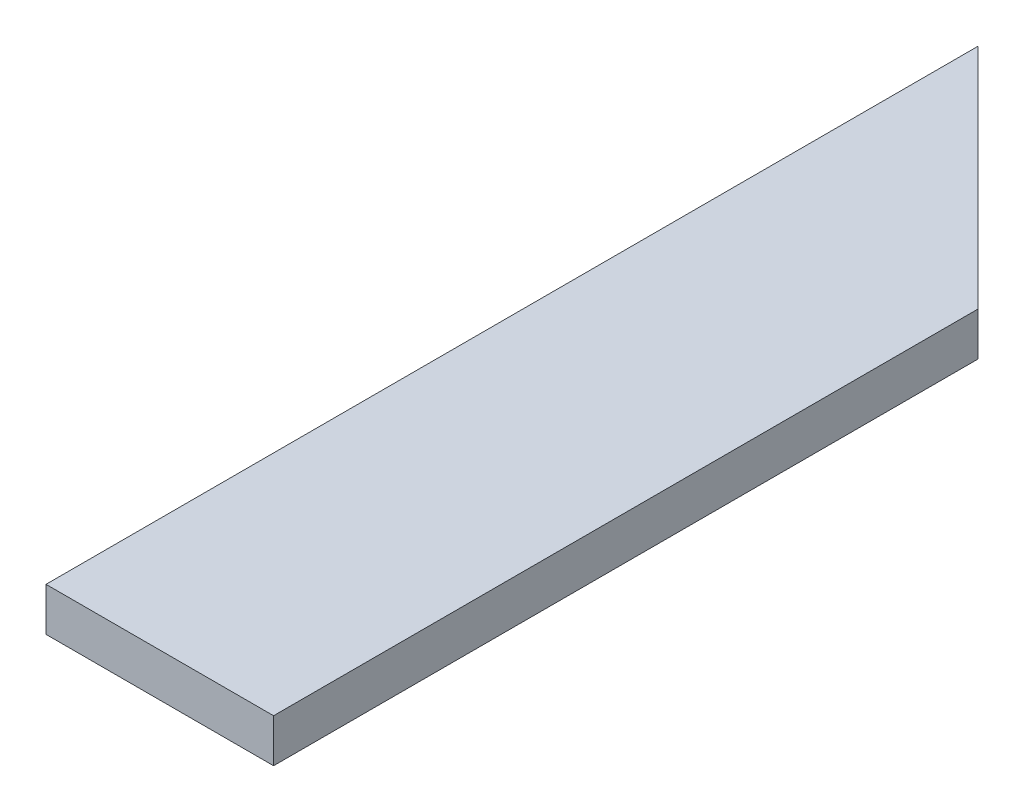
ISO-10303-21;
HEADER;
FILE_DESCRIPTION(('STEP AP214'),'2;1');
FILE_NAME('part.step','',(''),(''),'','','');
FILE_SCHEMA(('AUTOMOTIVE_DESIGN { 1 0 10303 214 1 1 1 1 }'));
ENDSEC;
DATA;
#1=APPLICATION_CONTEXT('core data for automotive mechanical design processes');
#2=APPLICATION_PROTOCOL_DEFINITION('international standard','automotive_design',2000,#1);
#3=PRODUCT_CONTEXT('',#1,'mechanical');
#4=PRODUCT('Part','Part','',(#3));
#5=PRODUCT_RELATED_PRODUCT_CATEGORY('part','',(#4));
#6=PRODUCT_DEFINITION_FORMATION('','',#4);
#7=PRODUCT_DEFINITION_CONTEXT('part definition',#1,'design');
#8=PRODUCT_DEFINITION('design','',#6,#7);
#9=PRODUCT_DEFINITION_SHAPE('','',#8);
#10=(LENGTH_UNIT() NAMED_UNIT(*) SI_UNIT(.MILLI.,.METRE.));
#11=(NAMED_UNIT(*) PLANE_ANGLE_UNIT() SI_UNIT($,.RADIAN.));
#12=(NAMED_UNIT(*) SI_UNIT($,.STERADIAN.) SOLID_ANGLE_UNIT());
#13=UNCERTAINTY_MEASURE_WITH_UNIT(LENGTH_MEASURE(1.E-05),#10,'distance_accuracy_value','');
#14=(GEOMETRIC_REPRESENTATION_CONTEXT(3) GLOBAL_UNCERTAINTY_ASSIGNED_CONTEXT((#13)) GLOBAL_UNIT_ASSIGNED_CONTEXT((#10,
#11,#12)) REPRESENTATION_CONTEXT('',''));
#15=CARTESIAN_POINT('',(0.,0.,0.));
#16=DIRECTION('',(0.,0.,1.));
#17=DIRECTION('',(1.,0.,0.));
#18=AXIS2_PLACEMENT_3D('',#15,#16,#17);
#19=CARTESIAN_POINT('',(0.,8.,130.));
#20=DIRECTION('',(0.,0.,-1.));
#21=DIRECTION('',(-1.,0.,0.));
#22=AXIS2_PLACEMENT_3D('',#19,#20,#21);
#23=PLANE('',#22);
#24=DIRECTION('',(1.,0.,0.));
#25=VECTOR('',#24,1.);
#26=CARTESIAN_POINT('',(0.,0.,130.));
#27=LINE('',#26,#25);
#28=CARTESIAN_POINT('',(0.,0.,130.));
#29=VERTEX_POINT('',#28);
#30=CARTESIAN_POINT('',(42.,0.,130.));
#31=VERTEX_POINT('',#30);
#32=EDGE_CURVE('E89',#29,#31,#27,.T.);
#33=ORIENTED_EDGE('',*,*,#32,.T.);
#34=DIRECTION('',(0.,-1.,0.));
#35=VECTOR('',#34,1.);
#36=CARTESIAN_POINT('',(42.,8.,130.));
#37=LINE('',#36,#35);
#38=CARTESIAN_POINT('',(42.,8.,130.));
#39=VERTEX_POINT('',#38);
#40=EDGE_CURVE('E43',#39,#31,#37,.T.);
#41=ORIENTED_EDGE('',*,*,#40,.F.);
#42=DIRECTION('',(1.,0.,0.));
#43=VECTOR('',#42,1.);
#44=CARTESIAN_POINT('',(0.,8.,130.));
#45=LINE('',#44,#43);
#46=CARTESIAN_POINT('',(0.,8.,130.));
#47=VERTEX_POINT('',#46);
#48=EDGE_CURVE('E82',#47,#39,#45,.T.);
#49=ORIENTED_EDGE('',*,*,#48,.F.);
#50=DIRECTION('',(0.,-1.,0.));
#51=VECTOR('',#50,1.);
#52=CARTESIAN_POINT('',(0.,8.,130.));
#53=LINE('',#52,#51);
#54=EDGE_CURVE('E11',#47,#29,#53,.T.);
#55=ORIENTED_EDGE('',*,*,#54,.T.);
#56=EDGE_LOOP('',(#33,#41,#49,#55));
#57=FACE_BOUND('',#56,.T.);
#58=ADVANCED_FACE('F35',(#57),#23,.F.);
#59=CARTESIAN_POINT('',(42.,8.,0.));
#60=DIRECTION('',(-1.,0.,0.));
#61=DIRECTION('',(0.,0.,1.));
#62=AXIS2_PLACEMENT_3D('',#59,#60,#61);
#63=PLANE('',#62);
#64=DIRECTION('',(0.,0.,-1.));
#65=VECTOR('',#64,1.);
#66=CARTESIAN_POINT('',(42.,0.,0.));
#67=LINE('',#66,#65);
#68=CARTESIAN_POINT('',(42.,0.,0.));
#69=VERTEX_POINT('',#68);
#70=EDGE_CURVE('E69',#31,#69,#67,.T.);
#71=ORIENTED_EDGE('',*,*,#70,.T.);
#72=DIRECTION('',(0.,-1.,0.));
#73=VECTOR('',#72,1.);
#74=CARTESIAN_POINT('',(42.,8.,0.));
#75=LINE('',#74,#73);
#76=CARTESIAN_POINT('',(42.,8.,0.));
#77=VERTEX_POINT('',#76);
#78=EDGE_CURVE('E90',#77,#69,#75,.T.);
#79=ORIENTED_EDGE('',*,*,#78,.F.);
#80=DIRECTION('',(0.,0.,-1.));
#81=VECTOR('',#80,1.);
#82=CARTESIAN_POINT('',(42.,8.,0.));
#83=LINE('',#82,#81);
#84=EDGE_CURVE('E86',#39,#77,#83,.T.);
#85=ORIENTED_EDGE('',*,*,#84,.F.);
#86=ORIENTED_EDGE('',*,*,#40,.T.);
#87=EDGE_LOOP('',(#71,#79,#85,#86));
#88=FACE_BOUND('',#87,.T.);
#89=ADVANCED_FACE('F91',(#88),#63,.F.);
#90=CARTESIAN_POINT('',(0.,8.,-42.));
#91=DIRECTION('',(-0.707106781186547,0.,0.707106781186548));
#92=DIRECTION('',(0.707106781186548,0.,0.707106781186547));
#93=AXIS2_PLACEMENT_3D('',#90,#91,#92);
#94=PLANE('',#93);
#95=DIRECTION('',(-0.707106781186548,0.,-0.707106781186548));
#96=VECTOR('',#95,1.);
#97=CARTESIAN_POINT('',(0.,0.,-42.));
#98=LINE('',#97,#96);
#99=CARTESIAN_POINT('',(0.,0.,-42.));
#100=VERTEX_POINT('',#99);
#101=EDGE_CURVE('E76',#69,#100,#98,.T.);
#102=ORIENTED_EDGE('',*,*,#101,.T.);
#103=DIRECTION('',(0.,-1.,0.));
#104=VECTOR('',#103,1.);
#105=CARTESIAN_POINT('',(0.,8.,-42.));
#106=LINE('',#105,#104);
#107=CARTESIAN_POINT('',(0.,8.,-42.));
#108=VERTEX_POINT('',#107);
#109=EDGE_CURVE('E95',#108,#100,#106,.T.);
#110=ORIENTED_EDGE('',*,*,#109,.F.);
#111=DIRECTION('',(-0.707106781186548,0.,-0.707106781186548));
#112=VECTOR('',#111,1.);
#113=CARTESIAN_POINT('',(0.,8.,-42.));
#114=LINE('',#113,#112);
#115=EDGE_CURVE('E93',#77,#108,#114,.T.);
#116=ORIENTED_EDGE('',*,*,#115,.F.);
#117=ORIENTED_EDGE('',*,*,#78,.T.);
#118=EDGE_LOOP('',(#102,#110,#116,#117));
#119=FACE_BOUND('',#118,.T.);
#120=ADVANCED_FACE('F105',(#119),#94,.F.);
#121=CARTESIAN_POINT('',(0.,8.,0.));
#122=DIRECTION('',(1.,0.,0.));
#123=DIRECTION('',(0.,0.,-1.));
#124=AXIS2_PLACEMENT_3D('',#121,#122,#123);
#125=PLANE('',#124);
#126=DIRECTION('',(0.,0.,1.));
#127=VECTOR('',#126,1.);
#128=CARTESIAN_POINT('',(0.,0.,0.));
#129=LINE('',#128,#127);
#130=EDGE_CURVE('E102',#100,#29,#129,.T.);
#131=ORIENTED_EDGE('',*,*,#130,.T.);
#132=ORIENTED_EDGE('',*,*,#54,.F.);
#133=DIRECTION('',(0.,0.,1.));
#134=VECTOR('',#133,1.);
#135=CARTESIAN_POINT('',(0.,8.,0.));
#136=LINE('',#135,#134);
#137=EDGE_CURVE('E51',#108,#47,#136,.T.);
#138=ORIENTED_EDGE('',*,*,#137,.F.);
#139=ORIENTED_EDGE('',*,*,#109,.T.);
#140=EDGE_LOOP('',(#131,#132,#138,#139));
#141=FACE_BOUND('',#140,.T.);
#142=ADVANCED_FACE('F109',(#141),#125,.F.);
#143=CARTESIAN_POINT('',(0.,8.,0.));
#144=DIRECTION('',(0.,1.,0.));
#145=DIRECTION('',(0.,0.,1.));
#146=AXIS2_PLACEMENT_3D('',#143,#144,#145);
#147=PLANE('',#146);
#148=ORIENTED_EDGE('',*,*,#137,.T.);
#149=ORIENTED_EDGE('',*,*,#48,.T.);
#150=ORIENTED_EDGE('',*,*,#84,.T.);
#151=ORIENTED_EDGE('',*,*,#115,.T.);
#152=EDGE_LOOP('',(#148,#149,#150,#151));
#153=FACE_BOUND('',#152,.T.);
#154=ADVANCED_FACE('F84',(#153),#147,.T.);
#155=CARTESIAN_POINT('',(0.,0.,0.));
#156=DIRECTION('',(0.,1.,0.));
#157=DIRECTION('',(0.,0.,1.));
#158=AXIS2_PLACEMENT_3D('',#155,#156,#157);
#159=PLANE('',#158);
#160=ORIENTED_EDGE('',*,*,#32,.F.);
#161=ORIENTED_EDGE('',*,*,#130,.F.);
#162=ORIENTED_EDGE('',*,*,#101,.F.);
#163=ORIENTED_EDGE('',*,*,#70,.F.);
#164=EDGE_LOOP('',(#160,#161,#162,#163));
#165=FACE_BOUND('',#164,.T.);
#166=ADVANCED_FACE('F108',(#165),#159,.F.);
#167=CLOSED_SHELL('',(#58,#89,#120,#142,#154,#166));
#168=MANIFOLD_SOLID_BREP('B2',#167);
#169=ADVANCED_BREP_SHAPE_REPRESENTATION('',(#18,#168),#14);
#170=SHAPE_DEFINITION_REPRESENTATION(#9,#169);
ENDSEC;
END-ISO-10303-21;
